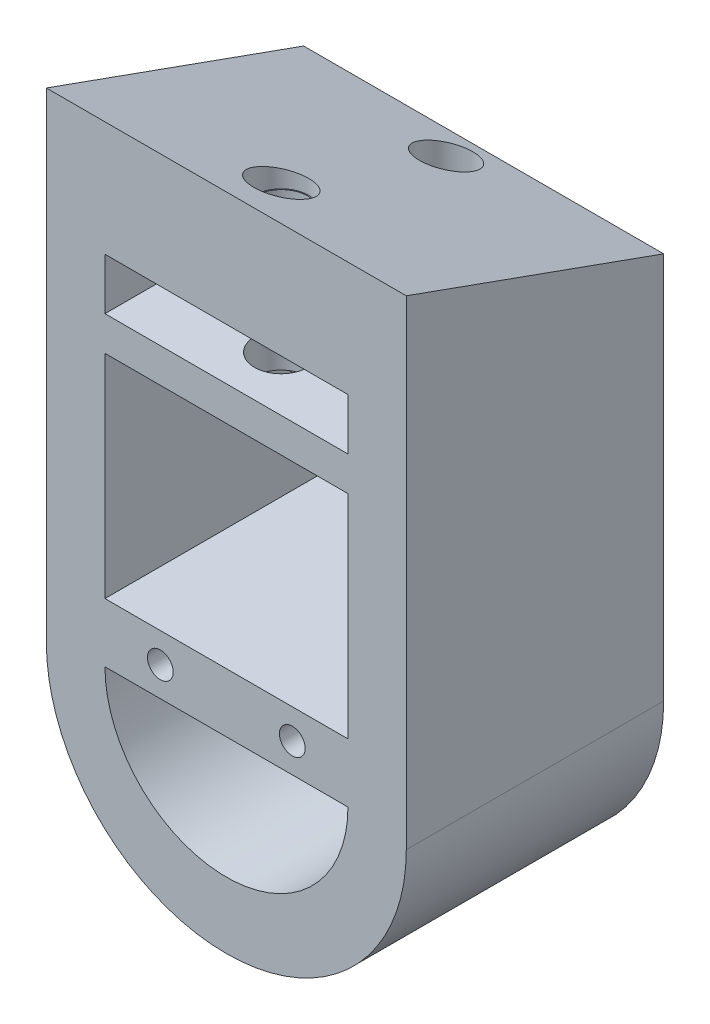
ISO-10303-21;
HEADER;
FILE_DESCRIPTION(('STEP AP214'),'2;1');
FILE_NAME('part.step','',(''),(''),'','','');
FILE_SCHEMA(('AUTOMOTIVE_DESIGN { 1 0 10303 214 1 1 1 1 }'));
ENDSEC;
DATA;
#1=APPLICATION_CONTEXT('core data for automotive mechanical design processes');
#2=APPLICATION_PROTOCOL_DEFINITION('international standard','automotive_design',2000,#1);
#3=PRODUCT_CONTEXT('',#1,'mechanical');
#4=PRODUCT('Part','Part','',(#3));
#5=PRODUCT_RELATED_PRODUCT_CATEGORY('part','',(#4));
#6=PRODUCT_DEFINITION_FORMATION('','',#4);
#7=PRODUCT_DEFINITION_CONTEXT('part definition',#1,'design');
#8=PRODUCT_DEFINITION('design','',#6,#7);
#9=PRODUCT_DEFINITION_SHAPE('','',#8);
#10=(LENGTH_UNIT() NAMED_UNIT(*) SI_UNIT(.MILLI.,.METRE.));
#11=(NAMED_UNIT(*) PLANE_ANGLE_UNIT() SI_UNIT($,.RADIAN.));
#12=(NAMED_UNIT(*) SI_UNIT($,.STERADIAN.) SOLID_ANGLE_UNIT());
#13=UNCERTAINTY_MEASURE_WITH_UNIT(LENGTH_MEASURE(1.E-05),#10,'distance_accuracy_value','');
#14=(GEOMETRIC_REPRESENTATION_CONTEXT(3) GLOBAL_UNCERTAINTY_ASSIGNED_CONTEXT((#13)) GLOBAL_UNIT_ASSIGNED_CONTEXT((#10,
#11,#12)) REPRESENTATION_CONTEXT('',''));
#15=CARTESIAN_POINT('',(0.,0.,0.));
#16=DIRECTION('',(0.,0.,1.));
#17=DIRECTION('',(1.,0.,0.));
#18=AXIS2_PLACEMENT_3D('',#15,#16,#17);
#19=CARTESIAN_POINT('',(-7.0731814338103,0.,20.));
#20=DIRECTION('',(1.,0.,0.));
#21=DIRECTION('',(0.,1.,0.));
#22=AXIS2_PLACEMENT_3D('',#19,#20,#21);
#23=PLANE('',#22);
#24=DIRECTION('',(0.,-1.,0.));
#25=VECTOR('',#24,1.);
#26=CARTESIAN_POINT('',(-7.0731814338103,0.,0.));
#27=LINE('',#26,#25);
#28=CARTESIAN_POINT('',(-7.0731814338103,-4.22839662316623,0.));
#29=VERTEX_POINT('',#28);
#30=CARTESIAN_POINT('',(-7.0731814338103,-11.1068410590705,0.));
#31=VERTEX_POINT('',#30);
#32=EDGE_CURVE('E193',#29,#31,#27,.T.);
#33=ORIENTED_EDGE('',*,*,#32,.F.);
#34=DIRECTION('',(0.,0.,-1.));
#35=VECTOR('',#34,1.);
#36=CARTESIAN_POINT('',(-7.0731814338103,-4.22839662316623,5.));
#37=LINE('',#36,#35);
#38=CARTESIAN_POINT('',(-7.0731814338103,-4.22839662316623,5.));
#39=VERTEX_POINT('',#38);
#40=EDGE_CURVE('E174',#39,#29,#37,.T.);
#41=ORIENTED_EDGE('',*,*,#40,.F.);
#42=DIRECTION('',(0.,-1.,0.));
#43=VECTOR('',#42,1.);
#44=CARTESIAN_POINT('',(-7.0731814338103,-1.72839662316623,5.));
#45=LINE('',#44,#43);
#46=CARTESIAN_POINT('',(-7.0731814338103,-1.72839662316623,5.));
#47=VERTEX_POINT('',#46);
#48=EDGE_CURVE('E179',#47,#39,#45,.T.);
#49=ORIENTED_EDGE('',*,*,#48,.F.);
#50=DIRECTION('',(0.,0.,-1.));
#51=VECTOR('',#50,1.);
#52=CARTESIAN_POINT('',(-7.0731814338103,-1.72839662316623,5.));
#53=LINE('',#52,#51);
#54=CARTESIAN_POINT('',(-7.0731814338103,-1.72839662316623,0.));
#55=VERTEX_POINT('',#54);
#56=EDGE_CURVE('E484',#47,#55,#53,.T.);
#57=ORIENTED_EDGE('',*,*,#56,.T.);
#58=CARTESIAN_POINT('',(-7.0731814338103,1.27160337683377,0.));
#59=VERTEX_POINT('',#58);
#60=EDGE_CURVE('E345',#59,#55,#27,.T.);
#61=ORIENTED_EDGE('',*,*,#60,.F.);
#62=DIRECTION('',(0.,0.,-1.));
#63=VECTOR('',#62,1.);
#64=CARTESIAN_POINT('',(-7.0731814338103,1.27160337683377,15.));
#65=LINE('',#64,#63);
#66=CARTESIAN_POINT('',(-7.0731814338103,1.27160337683377,15.));
#67=VERTEX_POINT('',#66);
#68=EDGE_CURVE('E254',#67,#59,#65,.T.);
#69=ORIENTED_EDGE('',*,*,#68,.F.);
#70=DIRECTION('',(0.,1.,0.));
#71=VECTOR('',#70,1.);
#72=CARTESIAN_POINT('',(-7.0731814338103,0.,15.));
#73=LINE('',#72,#71);
#74=CARTESIAN_POINT('',(-7.0731814338103,-11.1068410590705,15.));
#75=VERTEX_POINT('',#74);
#76=EDGE_CURVE('E325',#75,#67,#73,.T.);
#77=ORIENTED_EDGE('',*,*,#76,.F.);
#78=DIRECTION('',(0.,0.,-1.));
#79=VECTOR('',#78,1.);
#80=CARTESIAN_POINT('',(-7.0731814338103,-11.1068410590705,20.));
#81=LINE('',#80,#79);
#82=EDGE_CURVE('E382',#75,#31,#81,.T.);
#83=ORIENTED_EDGE('',*,*,#82,.T.);
#84=EDGE_LOOP('',(#33,#41,#49,#57,#61,#69,#77,#83));
#85=FACE_BOUND('',#84,.T.);
#86=ADVANCED_FACE('F43',(#85),#23,.T.);
#87=CARTESIAN_POINT('',(7.08895690976563,0.,20.));
#88=DIRECTION('',(1.,0.,0.));
#89=DIRECTION('',(0.,0.,-1.));
#90=AXIS2_PLACEMENT_3D('',#87,#88,#89);
#91=PLANE('',#90);
#92=DIRECTION('',(0.,0.,-1.));
#93=VECTOR('',#92,1.);
#94=CARTESIAN_POINT('',(7.08895690976563,-4.22839662316623,5.));
#95=LINE('',#94,#93);
#96=CARTESIAN_POINT('',(7.08895690976563,-4.22839662316623,5.));
#97=VERTEX_POINT('',#96);
#98=CARTESIAN_POINT('',(7.08895690976563,-4.22839662316623,0.));
#99=VERTEX_POINT('',#98);
#100=EDGE_CURVE('E176',#97,#99,#95,.T.);
#101=ORIENTED_EDGE('',*,*,#100,.T.);
#102=DIRECTION('',(0.,-1.,0.));
#103=VECTOR('',#102,1.);
#104=CARTESIAN_POINT('',(7.08895690976563,0.,0.));
#105=LINE('',#104,#103);
#106=CARTESIAN_POINT('',(7.08895690976563,-11.1068410590705,0.));
#107=VERTEX_POINT('',#106);
#108=EDGE_CURVE('E349',#99,#107,#105,.T.);
#109=ORIENTED_EDGE('',*,*,#108,.T.);
#110=DIRECTION('',(0.,0.,-1.));
#111=VECTOR('',#110,1.);
#112=CARTESIAN_POINT('',(7.08895690976563,-11.1068410590705,20.));
#113=LINE('',#112,#111);
#114=CARTESIAN_POINT('',(7.08895690976563,-11.1068410590705,15.));
#115=VERTEX_POINT('',#114);
#116=EDGE_CURVE('E380',#115,#107,#113,.T.);
#117=ORIENTED_EDGE('',*,*,#116,.F.);
#118=DIRECTION('',(0.,1.,0.));
#119=VECTOR('',#118,1.);
#120=CARTESIAN_POINT('',(7.08895690976563,0.,15.));
#121=LINE('',#120,#119);
#122=CARTESIAN_POINT('',(7.08895690976563,1.27160337683377,15.));
#123=VERTEX_POINT('',#122);
#124=EDGE_CURVE('E318',#115,#123,#121,.T.);
#125=ORIENTED_EDGE('',*,*,#124,.T.);
#126=DIRECTION('',(0.,0.,-1.));
#127=VECTOR('',#126,1.);
#128=CARTESIAN_POINT('',(7.08895690976563,1.27160337683377,15.));
#129=LINE('',#128,#127);
#130=CARTESIAN_POINT('',(7.08895690976563,1.27160337683377,0.));
#131=VERTEX_POINT('',#130);
#132=EDGE_CURVE('E250',#123,#131,#129,.T.);
#133=ORIENTED_EDGE('',*,*,#132,.T.);
#134=CARTESIAN_POINT('',(7.08895690976563,-1.72839662316623,0.));
#135=VERTEX_POINT('',#134);
#136=EDGE_CURVE('E351',#131,#135,#105,.T.);
#137=ORIENTED_EDGE('',*,*,#136,.T.);
#138=DIRECTION('',(0.,0.,-1.));
#139=VECTOR('',#138,1.);
#140=CARTESIAN_POINT('',(7.08895690976563,-1.72839662316623,5.));
#141=LINE('',#140,#139);
#142=CARTESIAN_POINT('',(7.08895690976563,-1.72839662316623,5.));
#143=VERTEX_POINT('',#142);
#144=EDGE_CURVE('E66',#143,#135,#141,.T.);
#145=ORIENTED_EDGE('',*,*,#144,.F.);
#146=DIRECTION('',(0.,1.,0.));
#147=VECTOR('',#146,1.);
#148=CARTESIAN_POINT('',(7.08895690976563,-1.72839662316623,5.));
#149=LINE('',#148,#147);
#150=EDGE_CURVE('E61',#97,#143,#149,.T.);
#151=ORIENTED_EDGE('',*,*,#150,.F.);
#152=EDGE_LOOP('',(#101,#109,#117,#125,#133,#137,#145,#151));
#153=FACE_BOUND('',#152,.T.);
#154=ADVANCED_FACE('F422',(#153),#91,.F.);
#155=CARTESIAN_POINT('',(-10.4889569097656,12.9548768402875,15.));
#156=DIRECTION('',(0.,-0.941259230068552,0.337684855761636));
#157=DIRECTION('',(0.,-0.337684855761637,-0.941259230068552));
#158=AXIS2_PLACEMENT_3D('',#155,#156,#157);
#159=PLANE('',#158);
#160=CARTESIAN_POINT('',(0.,8.3596899757842,2.19142426346608));
#161=DIRECTION('',(0.,-0.941259230068552,0.337684855761636));
#162=DIRECTION('',(0.,-0.337684855761637,-0.941259230068552));
#163=AXIS2_PLACEMENT_3D('',#160,#161,#162);
#164=ELLIPSE('',#163,1.64673019980597,1.55);
#165=CARTESIAN_POINT('',(0.,7.80361412578439,0.641424263466078));
#166=VERTEX_POINT('',#165);
#167=EDGE_CURVE('E480',#166,#166,#164,.F.);
#168=ORIENTED_EDGE('',*,*,#167,.F.);
#169=EDGE_LOOP('',(#168));
#170=FACE_BOUND('',#169,.T.);
#171=DIRECTION('',(0.,-0.337684855761637,-0.941259230068552));
#172=VECTOR('',#171,1.);
#173=CARTESIAN_POINT('',(10.4889569097656,12.9548768402875,15.));
#174=LINE('',#173,#172);
#175=CARTESIAN_POINT('',(10.4889569097656,12.9548768402875,15.));
#176=VERTEX_POINT('',#175);
#177=CARTESIAN_POINT('',(10.4889569097656,7.57349764674091,0.));
#178=VERTEX_POINT('',#177);
#179=EDGE_CURVE('E277',#176,#178,#174,.T.);
#180=ORIENTED_EDGE('',*,*,#179,.T.);
#181=DIRECTION('',(1.,0.,0.));
#182=VECTOR('',#181,1.);
#183=CARTESIAN_POINT('',(-10.4889569097656,7.57349764674091,0.));
#184=LINE('',#183,#182);
#185=CARTESIAN_POINT('',(-10.4889569097656,7.57349764674091,0.));
#186=VERTEX_POINT('',#185);
#187=EDGE_CURVE('E285',#186,#178,#184,.T.);
#188=ORIENTED_EDGE('',*,*,#187,.F.);
#189=DIRECTION('',(0.,-0.337684855761637,-0.941259230068552));
#190=VECTOR('',#189,1.);
#191=CARTESIAN_POINT('',(-10.4889569097656,12.9548768402875,15.));
#192=LINE('',#191,#190);
#193=CARTESIAN_POINT('',(-10.4889569097656,12.9548768402875,15.));
#194=VERTEX_POINT('',#193);
#195=EDGE_CURVE('E281',#194,#186,#192,.T.);
#196=ORIENTED_EDGE('',*,*,#195,.F.);
#197=DIRECTION('',(1.,0.,0.));
#198=VECTOR('',#197,1.);
#199=CARTESIAN_POINT('',(12.,12.9548768402875,15.));
#200=LINE('',#199,#198);
#201=EDGE_CURVE('E300',#194,#176,#200,.T.);
#202=ORIENTED_EDGE('',*,*,#201,.T.);
#203=EDGE_LOOP('',(#180,#188,#196,#202));
#204=FACE_BOUND('',#203,.T.);
#205=CARTESIAN_POINT('',(0.,11.805398583574,11.7959563467709));
#206=DIRECTION('',(0.,-0.941259230068552,0.337684855761636));
#207=DIRECTION('',(0.,-0.337684855761637,-0.941259230068552));
#208=AXIS2_PLACEMENT_3D('',#205,#206,#207);
#209=ELLIPSE('',#208,1.69985052883197,1.6);
#210=CARTESIAN_POINT('',(0.,11.231384802929,10.1959563467709));
#211=VERTEX_POINT('',#210);
#212=EDGE_CURVE('E288',#211,#211,#209,.T.);
#213=ORIENTED_EDGE('',*,*,#212,.T.);
#214=EDGE_LOOP('',(#213));
#215=FACE_BOUND('',#214,.T.);
#216=ADVANCED_FACE('F428',(#170,#204,#215),#159,.F.);
#217=CARTESIAN_POINT('',(-7.07318143381031,3.27160337683377,15.));
#218=VERTEX_POINT('',#217);
#219=CARTESIAN_POINT('',(-7.0731814338103,6.27160337683377,15.));
#220=VERTEX_POINT('',#219);
#221=EDGE_CURVE('E324',#218,#220,#73,.T.);
#222=ORIENTED_EDGE('',*,*,#221,.F.);
#223=DIRECTION('',(0.,0.,-1.));
#224=VECTOR('',#223,1.);
#225=CARTESIAN_POINT('',(-7.0731814338103,3.27160337683377,15.));
#226=LINE('',#225,#224);
#227=CARTESIAN_POINT('',(-7.0731814338103,3.27160337683377,0.));
#228=VERTEX_POINT('',#227);
#229=EDGE_CURVE('E237',#218,#228,#226,.T.);
#230=ORIENTED_EDGE('',*,*,#229,.T.);
#231=CARTESIAN_POINT('',(-7.0731814338103,6.27160337683377,0.));
#232=VERTEX_POINT('',#231);
#233=EDGE_CURVE('E350',#232,#228,#27,.T.);
#234=ORIENTED_EDGE('',*,*,#233,.F.);
#235=DIRECTION('',(0.,0.,-1.));
#236=VECTOR('',#235,1.);
#237=CARTESIAN_POINT('',(-7.0731814338103,6.27160337683377,15.));
#238=LINE('',#237,#236);
#239=EDGE_CURVE('E270',#220,#232,#238,.T.);
#240=ORIENTED_EDGE('',*,*,#239,.F.);
#241=EDGE_LOOP('',(#222,#230,#234,#240));
#242=FACE_BOUND('',#241,.T.);
#243=ADVANCED_FACE('F424',(#242),#23,.T.);
#244=DIRECTION('',(0.,0.,-1.));
#245=VECTOR('',#244,1.);
#246=CARTESIAN_POINT('',(7.08895690976563,3.27160337683377,15.));
#247=LINE('',#246,#245);
#248=CARTESIAN_POINT('',(7.08895690976563,3.27160337683377,15.));
#249=VERTEX_POINT('',#248);
#250=CARTESIAN_POINT('',(7.08895690976563,3.27160337683377,0.));
#251=VERTEX_POINT('',#250);
#252=EDGE_CURVE('E246',#249,#251,#247,.T.);
#253=ORIENTED_EDGE('',*,*,#252,.F.);
#254=DIRECTION('',(0.,1.,0.));
#255=VECTOR('',#254,1.);
#256=CARTESIAN_POINT('',(7.08895690976563,0.,15.));
#257=LINE('',#256,#255);
#258=CARTESIAN_POINT('',(7.08895690976563,6.27160337683377,15.));
#259=VERTEX_POINT('',#258);
#260=EDGE_CURVE('E321',#249,#259,#257,.T.);
#261=ORIENTED_EDGE('',*,*,#260,.T.);
#262=DIRECTION('',(0.,0.,-1.));
#263=VECTOR('',#262,1.);
#264=CARTESIAN_POINT('',(7.08895690976563,6.27160337683377,15.));
#265=LINE('',#264,#263);
#266=CARTESIAN_POINT('',(7.08895690976563,6.27160337683377,0.));
#267=VERTEX_POINT('',#266);
#268=EDGE_CURVE('E263',#259,#267,#265,.T.);
#269=ORIENTED_EDGE('',*,*,#268,.T.);
#270=EDGE_CURVE('E355',#267,#251,#105,.T.);
#271=ORIENTED_EDGE('',*,*,#270,.T.);
#272=EDGE_LOOP('',(#253,#261,#269,#271));
#273=FACE_BOUND('',#272,.T.);
#274=ADVANCED_FACE('F430',(#273),#91,.F.);
#275=CARTESIAN_POINT('',(-10.4889569097656,0.,20.));
#276=DIRECTION('',(1.,0.,0.));
#277=DIRECTION('',(0.,0.,-1.));
#278=AXIS2_PLACEMENT_3D('',#275,#276,#277);
#279=PLANE('',#278);
#280=DIRECTION('',(0.,1.,0.));
#281=VECTOR('',#280,1.);
#282=CARTESIAN_POINT('',(-10.4889569097656,0.,15.));
#283=LINE('',#282,#281);
#284=CARTESIAN_POINT('',(-10.4889569097656,-15.,15.));
#285=VERTEX_POINT('',#284);
#286=EDGE_CURVE('E296',#285,#194,#283,.T.);
#287=ORIENTED_EDGE('',*,*,#286,.T.);
#288=ORIENTED_EDGE('',*,*,#195,.T.);
#289=DIRECTION('',(0.,-1.,0.));
#290=VECTOR('',#289,1.);
#291=CARTESIAN_POINT('',(-10.4889569097656,0.,0.));
#292=LINE('',#291,#290);
#293=CARTESIAN_POINT('',(-10.4889569097656,-15.,0.));
#294=VERTEX_POINT('',#293);
#295=EDGE_CURVE('E359',#186,#294,#292,.T.);
#296=ORIENTED_EDGE('',*,*,#295,.T.);
#297=DIRECTION('',(0.,0.,-1.));
#298=VECTOR('',#297,1.);
#299=CARTESIAN_POINT('',(-10.4889569097656,-15.,20.));
#300=LINE('',#299,#298);
#301=EDGE_CURVE('E11',#285,#294,#300,.T.);
#302=ORIENTED_EDGE('',*,*,#301,.F.);
#303=EDGE_LOOP('',(#287,#288,#296,#302));
#304=FACE_BOUND('',#303,.T.);
#305=ADVANCED_FACE('F438',(#304),#279,.F.);
#306=CARTESIAN_POINT('',(0.,-15.,20.));
#307=DIRECTION('',(0.,0.,-1.));
#308=DIRECTION('',(-1.,0.,0.));
#309=AXIS2_PLACEMENT_3D('',#306,#307,#308);
#310=CYLINDRICAL_SURFACE('',#309,10.4889569097656);
#311=DIRECTION('',(0.,0.,-1.));
#312=VECTOR('',#311,1.);
#313=CARTESIAN_POINT('',(10.4889569097656,-15.,20.));
#314=LINE('',#313,#312);
#315=CARTESIAN_POINT('',(10.4889569097656,-15.,15.));
#316=VERTEX_POINT('',#315);
#317=CARTESIAN_POINT('',(10.4889569097656,-15.,0.));
#318=VERTEX_POINT('',#317);
#319=EDGE_CURVE('E53',#316,#318,#314,.T.);
#320=ORIENTED_EDGE('',*,*,#319,.F.);
#321=CARTESIAN_POINT('',(0.,-15.,15.));
#322=DIRECTION('',(0.,0.,-1.));
#323=DIRECTION('',(-1.,0.,0.));
#324=AXIS2_PLACEMENT_3D('',#321,#322,#323);
#325=CIRCLE('',#324,10.4889569097656);
#326=EDGE_CURVE('E333',#316,#285,#325,.T.);
#327=ORIENTED_EDGE('',*,*,#326,.T.);
#328=ORIENTED_EDGE('',*,*,#301,.T.);
#329=CARTESIAN_POINT('',(0.,-15.,0.));
#330=DIRECTION('',(0.,0.,1.));
#331=DIRECTION('',(1.,0.,0.));
#332=AXIS2_PLACEMENT_3D('',#329,#330,#331);
#333=CIRCLE('',#332,10.4889569097656);
#334=EDGE_CURVE('E362',#294,#318,#333,.T.);
#335=ORIENTED_EDGE('',*,*,#334,.T.);
#336=EDGE_LOOP('',(#320,#327,#328,#335));
#337=FACE_BOUND('',#336,.T.);
#338=ADVANCED_FACE('F748',(#337),#310,.T.);
#339=CARTESIAN_POINT('',(10.4889569097656,0.,20.));
#340=DIRECTION('',(1.,0.,0.));
#341=DIRECTION('',(0.,0.,-1.));
#342=AXIS2_PLACEMENT_3D('',#339,#340,#341);
#343=PLANE('',#342);
#344=ORIENTED_EDGE('',*,*,#179,.F.);
#345=DIRECTION('',(0.,1.,0.));
#346=VECTOR('',#345,1.);
#347=CARTESIAN_POINT('',(10.4889569097656,0.,15.));
#348=LINE('',#347,#346);
#349=EDGE_CURVE('E292',#316,#176,#348,.T.);
#350=ORIENTED_EDGE('',*,*,#349,.F.);
#351=ORIENTED_EDGE('',*,*,#319,.T.);
#352=DIRECTION('',(0.,-1.,0.));
#353=VECTOR('',#352,1.);
#354=CARTESIAN_POINT('',(10.4889569097656,0.,0.));
#355=LINE('',#354,#353);
#356=EDGE_CURVE('E366',#178,#318,#355,.T.);
#357=ORIENTED_EDGE('',*,*,#356,.F.);
#358=EDGE_LOOP('',(#344,#350,#351,#357));
#359=FACE_BOUND('',#358,.T.);
#360=ADVANCED_FACE('F743',(#359),#343,.T.);
#361=CARTESIAN_POINT('',(0.00788773797766491,-14.5468410590705,20.));
#362=DIRECTION('',(0.,0.,-1.));
#363=DIRECTION('',(-1.,0.,0.));
#364=AXIS2_PLACEMENT_3D('',#361,#362,#363);
#365=CYLINDRICAL_SURFACE('',#364,7.08106917178797);
#366=CARTESIAN_POINT('',(0.00788773797766491,-14.5468410590705,15.));
#367=DIRECTION('',(0.,0.,-1.));
#368=DIRECTION('',(-1.,0.,0.));
#369=AXIS2_PLACEMENT_3D('',#366,#367,#368);
#370=CIRCLE('',#369,7.08106917178797);
#371=CARTESIAN_POINT('',(7.08895690976563,-14.5468410590705,15.));
#372=VERTEX_POINT('',#371);
#373=CARTESIAN_POINT('',(-7.0731814338103,-14.5468410590705,15.));
#374=VERTEX_POINT('',#373);
#375=EDGE_CURVE('E311',#372,#374,#370,.T.);
#376=ORIENTED_EDGE('',*,*,#375,.F.);
#377=DIRECTION('',(0.,0.,-1.));
#378=VECTOR('',#377,1.);
#379=CARTESIAN_POINT('',(7.08895690976563,-14.5468410590705,20.));
#380=LINE('',#379,#378);
#381=CARTESIAN_POINT('',(7.08895690976563,-14.5468410590705,0.));
#382=VERTEX_POINT('',#381);
#383=EDGE_CURVE('E377',#372,#382,#380,.T.);
#384=ORIENTED_EDGE('',*,*,#383,.T.);
#385=CARTESIAN_POINT('',(0.00788773797766491,-14.5468410590705,0.));
#386=DIRECTION('',(0.,0.,1.));
#387=DIRECTION('',(1.,0.,0.));
#388=AXIS2_PLACEMENT_3D('',#385,#386,#387);
#389=CIRCLE('',#388,7.08106917178797);
#390=CARTESIAN_POINT('',(-7.0731814338103,-14.5468410590705,0.));
#391=VERTEX_POINT('',#390);
#392=EDGE_CURVE('E337',#391,#382,#389,.T.);
#393=ORIENTED_EDGE('',*,*,#392,.F.);
#394=DIRECTION('',(0.,0.,-1.));
#395=VECTOR('',#394,1.);
#396=CARTESIAN_POINT('',(-7.0731814338103,-14.5468410590705,20.));
#397=LINE('',#396,#395);
#398=EDGE_CURVE('E385',#374,#391,#397,.T.);
#399=ORIENTED_EDGE('',*,*,#398,.F.);
#400=EDGE_LOOP('',(#376,#384,#393,#399));
#401=FACE_BOUND('',#400,.T.);
#402=ADVANCED_FACE('F45',(#401),#365,.F.);
#403=CARTESIAN_POINT('',(3.84525214097818,-12.8374570664521,20.));
#404=DIRECTION('',(0.,0.,-1.));
#405=DIRECTION('',(-1.,0.,0.));
#406=AXIS2_PLACEMENT_3D('',#403,#404,#405);
#407=CYLINDRICAL_SURFACE('',#406,0.75);
#408=CARTESIAN_POINT('',(3.84525214097818,-12.8374570664521,15.));
#409=DIRECTION('',(0.,0.,-1.));
#410=DIRECTION('',(-1.,0.,0.));
#411=AXIS2_PLACEMENT_3D('',#408,#409,#410);
#412=CIRCLE('',#411,0.75);
#413=CARTESIAN_POINT('',(3.09525214097818,-12.8374570664521,15.));
#414=VERTEX_POINT('',#413);
#415=EDGE_CURVE('E329',#414,#414,#412,.F.);
#416=ORIENTED_EDGE('',*,*,#415,.T.);
#417=EDGE_LOOP('',(#416));
#418=FACE_BOUND('',#417,.T.);
#419=CARTESIAN_POINT('',(3.84525214097818,-12.8374570664521,0.));
#420=DIRECTION('',(0.,0.,1.));
#421=DIRECTION('',(1.,0.,0.));
#422=AXIS2_PLACEMENT_3D('',#419,#420,#421);
#423=CIRCLE('',#422,0.75);
#424=CARTESIAN_POINT('',(4.59525214097818,-12.8374570664521,0.));
#425=VERTEX_POINT('',#424);
#426=EDGE_CURVE('E369',#425,#425,#423,.F.);
#427=ORIENTED_EDGE('',*,*,#426,.T.);
#428=EDGE_LOOP('',(#427));
#429=FACE_BOUND('',#428,.T.);
#430=ADVANCED_FACE('F789',(#418,#429),#407,.F.);
#431=CARTESIAN_POINT('',(0.,-11.1068410590705,20.));
#432=DIRECTION('',(0.,1.,0.));
#433=DIRECTION('',(-1.,0.,0.));
#434=AXIS2_PLACEMENT_3D('',#431,#432,#433);
#435=PLANE('',#434);
#436=DIRECTION('',(-1.,0.,0.));
#437=VECTOR('',#436,1.);
#438=CARTESIAN_POINT('',(0.,-11.1068410590705,15.));
#439=LINE('',#438,#437);
#440=EDGE_CURVE('E314',#115,#75,#439,.T.);
#441=ORIENTED_EDGE('',*,*,#440,.F.);
#442=ORIENTED_EDGE('',*,*,#116,.T.);
#443=DIRECTION('',(1.,0.,0.));
#444=VECTOR('',#443,1.);
#445=CARTESIAN_POINT('',(0.,-11.1068410590705,0.));
#446=LINE('',#445,#444);
#447=EDGE_CURVE('E354',#31,#107,#446,.T.);
#448=ORIENTED_EDGE('',*,*,#447,.F.);
#449=ORIENTED_EDGE('',*,*,#82,.F.);
#450=EDGE_LOOP('',(#441,#442,#448,#449));
#451=FACE_BOUND('',#450,.T.);
#452=ADVANCED_FACE('F465',(#451),#435,.T.);
#453=CARTESIAN_POINT('',(0.,-14.5468410590705,20.));
#454=DIRECTION('',(0.,1.,0.));
#455=DIRECTION('',(0.,0.,1.));
#456=AXIS2_PLACEMENT_3D('',#453,#454,#455);
#457=PLANE('',#456);
#458=ORIENTED_EDGE('',*,*,#383,.F.);
#459=DIRECTION('',(-1.,0.,0.));
#460=VECTOR('',#459,1.);
#461=CARTESIAN_POINT('',(0.,-14.5468410590705,15.));
#462=LINE('',#461,#460);
#463=EDGE_CURVE('E307',#372,#374,#462,.T.);
#464=ORIENTED_EDGE('',*,*,#463,.T.);
#465=ORIENTED_EDGE('',*,*,#398,.T.);
#466=DIRECTION('',(1.,0.,0.));
#467=VECTOR('',#466,1.);
#468=CARTESIAN_POINT('',(0.,-14.5468410590705,0.));
#469=LINE('',#468,#467);
#470=EDGE_CURVE('E341',#391,#382,#469,.T.);
#471=ORIENTED_EDGE('',*,*,#470,.T.);
#472=EDGE_LOOP('',(#458,#464,#465,#471));
#473=FACE_BOUND('',#472,.T.);
#474=ADVANCED_FACE('F770',(#473),#457,.F.);
#475=CARTESIAN_POINT('',(-3.84525214097818,-12.8374570664521,20.));
#476=DIRECTION('',(0.,0.,-1.));
#477=DIRECTION('',(-1.,0.,0.));
#478=AXIS2_PLACEMENT_3D('',#475,#476,#477);
#479=CYLINDRICAL_SURFACE('',#478,0.75);
#480=CARTESIAN_POINT('',(-3.84525214097818,-12.8374570664521,15.));
#481=DIRECTION('',(0.,0.,-1.));
#482=DIRECTION('',(-1.,0.,0.));
#483=AXIS2_PLACEMENT_3D('',#480,#481,#482);
#484=CIRCLE('',#483,0.75);
#485=CARTESIAN_POINT('',(-4.59525214097818,-12.8374570664521,15.));
#486=VERTEX_POINT('',#485);
#487=EDGE_CURVE('E303',#486,#486,#484,.T.);
#488=ORIENTED_EDGE('',*,*,#487,.F.);
#489=EDGE_LOOP('',(#488));
#490=FACE_BOUND('',#489,.T.);
#491=CARTESIAN_POINT('',(-3.84525214097818,-12.8374570664521,0.));
#492=DIRECTION('',(0.,0.,1.));
#493=DIRECTION('',(1.,0.,0.));
#494=AXIS2_PLACEMENT_3D('',#491,#492,#493);
#495=CIRCLE('',#494,0.75);
#496=CARTESIAN_POINT('',(-3.09525214097818,-12.8374570664521,0.));
#497=VERTEX_POINT('',#496);
#498=EDGE_CURVE('E373',#497,#497,#495,.T.);
#499=ORIENTED_EDGE('',*,*,#498,.F.);
#500=EDGE_LOOP('',(#499));
#501=FACE_BOUND('',#500,.T.);
#502=ADVANCED_FACE('F413',(#490,#501),#479,.F.);
#503=CARTESIAN_POINT('',(0.,0.,0.));
#504=DIRECTION('',(0.,0.,1.));
#505=DIRECTION('',(1.,0.,0.));
#506=AXIS2_PLACEMENT_3D('',#503,#504,#505);
#507=PLANE('',#506);
#508=DIRECTION('',(1.,0.,0.));
#509=VECTOR('',#508,1.);
#510=CARTESIAN_POINT('',(-7.0731814338103,-4.22839662316623,0.));
#511=LINE('',#510,#509);
#512=EDGE_CURVE('E468',#29,#99,#511,.T.);
#513=ORIENTED_EDGE('',*,*,#512,.F.);
#514=ORIENTED_EDGE('',*,*,#32,.T.);
#515=ORIENTED_EDGE('',*,*,#447,.T.);
#516=ORIENTED_EDGE('',*,*,#108,.F.);
#517=EDGE_LOOP('',(#513,#514,#515,#516));
#518=FACE_BOUND('',#517,.T.);
#519=ORIENTED_EDGE('',*,*,#187,.T.);
#520=ORIENTED_EDGE('',*,*,#356,.T.);
#521=ORIENTED_EDGE('',*,*,#334,.F.);
#522=ORIENTED_EDGE('',*,*,#295,.F.);
#523=EDGE_LOOP('',(#519,#520,#521,#522));
#524=FACE_BOUND('',#523,.T.);
#525=ORIENTED_EDGE('',*,*,#498,.T.);
#526=EDGE_LOOP('',(#525));
#527=FACE_BOUND('',#526,.T.);
#528=ORIENTED_EDGE('',*,*,#426,.F.);
#529=EDGE_LOOP('',(#528));
#530=FACE_BOUND('',#529,.T.);
#531=ORIENTED_EDGE('',*,*,#392,.T.);
#532=ORIENTED_EDGE('',*,*,#470,.F.);
#533=EDGE_LOOP('',(#531,#532));
#534=FACE_BOUND('',#533,.T.);
#535=DIRECTION('',(-1.,0.,0.));
#536=VECTOR('',#535,1.);
#537=CARTESIAN_POINT('',(0.,6.27160337683377,0.));
#538=LINE('',#537,#536);
#539=EDGE_CURVE('E258',#267,#232,#538,.T.);
#540=ORIENTED_EDGE('',*,*,#539,.T.);
#541=ORIENTED_EDGE('',*,*,#233,.T.);
#542=DIRECTION('',(-1.,0.,0.));
#543=VECTOR('',#542,1.);
#544=CARTESIAN_POINT('',(-7.0731814338103,3.27160337683377,0.));
#545=LINE('',#544,#543);
#546=EDGE_CURVE('E233',#251,#228,#545,.T.);
#547=ORIENTED_EDGE('',*,*,#546,.F.);
#548=ORIENTED_EDGE('',*,*,#270,.F.);
#549=EDGE_LOOP('',(#540,#541,#547,#548));
#550=FACE_BOUND('',#549,.T.);
#551=DIRECTION('',(1.,0.,0.));
#552=VECTOR('',#551,1.);
#553=CARTESIAN_POINT('',(-7.0731814338103,1.27160337683377,0.));
#554=LINE('',#553,#552);
#555=EDGE_CURVE('E227',#59,#131,#554,.T.);
#556=ORIENTED_EDGE('',*,*,#555,.F.);
#557=ORIENTED_EDGE('',*,*,#60,.T.);
#558=DIRECTION('',(-1.,0.,0.));
#559=VECTOR('',#558,1.);
#560=CARTESIAN_POINT('',(-7.0731814338103,-1.72839662316623,0.));
#561=LINE('',#560,#559);
#562=EDGE_CURVE('E189',#135,#55,#561,.T.);
#563=ORIENTED_EDGE('',*,*,#562,.F.);
#564=ORIENTED_EDGE('',*,*,#136,.F.);
#565=EDGE_LOOP('',(#556,#557,#563,#564));
#566=FACE_BOUND('',#565,.T.);
#567=ADVANCED_FACE('F402',(#518,#524,#527,#530,#534,#550,#566),#507,.F.);
#568=CARTESIAN_POINT('',(0.,50.,11.7959563467709));
#569=DIRECTION('',(0.,-1.,0.));
#570=DIRECTION('',(0.,0.,-1.));
#571=AXIS2_PLACEMENT_3D('',#568,#569,#570);
#572=CYLINDRICAL_SURFACE('',#571,1.6);
#573=ORIENTED_EDGE('',*,*,#212,.F.);
#574=EDGE_LOOP('',(#573));
#575=FACE_BOUND('',#574,.T.);
#576=CARTESIAN_POINT('',(0.,10.3768501504614,11.7959563467709));
#577=DIRECTION('',(0.,1.,0.));
#578=DIRECTION('',(0.,0.,1.));
#579=AXIS2_PLACEMENT_3D('',#576,#577,#578);
#580=CIRCLE('',#579,1.6);
#581=CARTESIAN_POINT('',(0.,10.3768501504614,13.3959563467709));
#582=VERTEX_POINT('',#581);
#583=EDGE_CURVE('E336',#582,#582,#580,.T.);
#584=ORIENTED_EDGE('',*,*,#583,.F.);
#585=EDGE_LOOP('',(#584));
#586=FACE_BOUND('',#585,.T.);
#587=ADVANCED_FACE('F399',(#575,#586),#572,.F.);
#588=CARTESIAN_POINT('',(-10.4889569097656,0.,15.));
#589=DIRECTION('',(0.,0.,-1.));
#590=DIRECTION('',(-1.,0.,0.));
#591=AXIS2_PLACEMENT_3D('',#588,#589,#590);
#592=PLANE('',#591);
#593=ORIENTED_EDGE('',*,*,#440,.T.);
#594=ORIENTED_EDGE('',*,*,#76,.T.);
#595=DIRECTION('',(1.,0.,0.));
#596=VECTOR('',#595,1.);
#597=CARTESIAN_POINT('',(-7.0731814338103,1.27160337683377,15.));
#598=LINE('',#597,#596);
#599=EDGE_CURVE('E228',#67,#123,#598,.T.);
#600=ORIENTED_EDGE('',*,*,#599,.T.);
#601=ORIENTED_EDGE('',*,*,#124,.F.);
#602=EDGE_LOOP('',(#593,#594,#600,#601));
#603=FACE_BOUND('',#602,.T.);
#604=DIRECTION('',(-1.,0.,0.));
#605=VECTOR('',#604,1.);
#606=CARTESIAN_POINT('',(-7.0731814338103,3.27160337683377,15.));
#607=LINE('',#606,#605);
#608=EDGE_CURVE('E232',#249,#218,#607,.T.);
#609=ORIENTED_EDGE('',*,*,#608,.T.);
#610=ORIENTED_EDGE('',*,*,#221,.T.);
#611=DIRECTION('',(-1.,0.,0.));
#612=VECTOR('',#611,1.);
#613=CARTESIAN_POINT('',(0.,6.27160337683377,15.));
#614=LINE('',#613,#612);
#615=EDGE_CURVE('E259',#259,#220,#614,.T.);
#616=ORIENTED_EDGE('',*,*,#615,.F.);
#617=ORIENTED_EDGE('',*,*,#260,.F.);
#618=EDGE_LOOP('',(#609,#610,#616,#617));
#619=FACE_BOUND('',#618,.T.);
#620=ORIENTED_EDGE('',*,*,#349,.T.);
#621=ORIENTED_EDGE('',*,*,#201,.F.);
#622=ORIENTED_EDGE('',*,*,#286,.F.);
#623=ORIENTED_EDGE('',*,*,#326,.F.);
#624=EDGE_LOOP('',(#620,#621,#622,#623));
#625=FACE_BOUND('',#624,.T.);
#626=ORIENTED_EDGE('',*,*,#415,.F.);
#627=EDGE_LOOP('',(#626));
#628=FACE_BOUND('',#627,.T.);
#629=ORIENTED_EDGE('',*,*,#375,.T.);
#630=ORIENTED_EDGE('',*,*,#463,.F.);
#631=EDGE_LOOP('',(#629,#630));
#632=FACE_BOUND('',#631,.T.);
#633=ORIENTED_EDGE('',*,*,#487,.T.);
#634=EDGE_LOOP('',(#633));
#635=FACE_BOUND('',#634,.T.);
#636=ADVANCED_FACE('F401',(#603,#619,#625,#628,#632,#635),#592,.F.);
#637=CARTESIAN_POINT('',(0.,6.27160337683377,15.));
#638=DIRECTION('',(0.,-1.,0.));
#639=DIRECTION('',(0.,0.,-1.));
#640=AXIS2_PLACEMENT_3D('',#637,#638,#639);
#641=PLANE('',#640);
#642=CARTESIAN_POINT('',(0.,6.27160337683377,2.19142426346608));
#643=DIRECTION('',(0.,-1.,0.));
#644=DIRECTION('',(0.,0.,-1.));
#645=AXIS2_PLACEMENT_3D('',#642,#643,#644);
#646=CIRCLE('',#645,1.55);
#647=CARTESIAN_POINT('',(0.,6.27160337683377,0.641424263466078));
#648=VERTEX_POINT('',#647);
#649=EDGE_CURVE('E495',#648,#648,#646,.F.);
#650=ORIENTED_EDGE('',*,*,#649,.T.);
#651=EDGE_LOOP('',(#650));
#652=FACE_BOUND('',#651,.T.);
#653=CARTESIAN_POINT('',(0.,6.27160337683377,11.8056508327026));
#654=DIRECTION('',(0.,-1.,0.));
#655=DIRECTION('',(0.,0.,-1.));
#656=AXIS2_PLACEMENT_3D('',#653,#654,#655);
#657=CIRCLE('',#656,1.55);
#658=CARTESIAN_POINT('',(0.,6.27160337683377,10.2556508327026));
#659=VERTEX_POINT('',#658);
#660=EDGE_CURVE('E219',#659,#659,#657,.F.);
#661=ORIENTED_EDGE('',*,*,#660,.T.);
#662=EDGE_LOOP('',(#661));
#663=FACE_BOUND('',#662,.T.);
#664=ORIENTED_EDGE('',*,*,#539,.F.);
#665=ORIENTED_EDGE('',*,*,#268,.F.);
#666=ORIENTED_EDGE('',*,*,#615,.T.);
#667=ORIENTED_EDGE('',*,*,#239,.T.);
#668=EDGE_LOOP('',(#664,#665,#666,#667));
#669=FACE_BOUND('',#668,.T.);
#670=ADVANCED_FACE('F410',(#652,#663,#669),#641,.T.);
#671=CARTESIAN_POINT('',(-7.0731814338103,1.27160337683377,15.));
#672=DIRECTION('',(0.,1.,0.));
#673=DIRECTION('',(0.,0.,1.));
#674=AXIS2_PLACEMENT_3D('',#671,#672,#673);
#675=PLANE('',#674);
#676=CARTESIAN_POINT('',(0.,1.27160337683377,2.19142426346608));
#677=DIRECTION('',(0.,1.,0.));
#678=DIRECTION('',(0.,0.,1.));
#679=AXIS2_PLACEMENT_3D('',#676,#677,#678);
#680=CIRCLE('',#679,1.55);
#681=CARTESIAN_POINT('',(0.,1.27160337683377,3.74142426346608));
#682=VERTEX_POINT('',#681);
#683=EDGE_CURVE('E499',#682,#682,#680,.F.);
#684=ORIENTED_EDGE('',*,*,#683,.F.);
#685=EDGE_LOOP('',(#684));
#686=FACE_BOUND('',#685,.T.);
#687=CARTESIAN_POINT('',(0.,1.27160337683377,11.8056508327026));
#688=DIRECTION('',(0.,1.,0.));
#689=DIRECTION('',(0.,0.,1.));
#690=AXIS2_PLACEMENT_3D('',#687,#688,#689);
#691=CIRCLE('',#690,1.55);
#692=CARTESIAN_POINT('',(0.,1.27160337683377,13.3556508327026));
#693=VERTEX_POINT('',#692);
#694=EDGE_CURVE('E215',#693,#693,#691,.F.);
#695=ORIENTED_EDGE('',*,*,#694,.F.);
#696=EDGE_LOOP('',(#695));
#697=FACE_BOUND('',#696,.T.);
#698=ORIENTED_EDGE('',*,*,#555,.T.);
#699=ORIENTED_EDGE('',*,*,#132,.F.);
#700=ORIENTED_EDGE('',*,*,#599,.F.);
#701=ORIENTED_EDGE('',*,*,#68,.T.);
#702=EDGE_LOOP('',(#698,#699,#700,#701));
#703=FACE_BOUND('',#702,.T.);
#704=ADVANCED_FACE('F474',(#686,#697,#703),#675,.F.);
#705=CARTESIAN_POINT('',(-7.0731814338103,3.27160337683377,15.));
#706=DIRECTION('',(0.,-1.,0.));
#707=DIRECTION('',(0.,0.,-1.));
#708=AXIS2_PLACEMENT_3D('',#705,#706,#707);
#709=PLANE('',#708);
#710=CARTESIAN_POINT('',(0.,3.27160337683377,2.19142426346608));
#711=DIRECTION('',(0.,-1.,0.));
#712=DIRECTION('',(0.,0.,-1.));
#713=AXIS2_PLACEMENT_3D('',#710,#711,#712);
#714=CIRCLE('',#713,1.55);
#715=CARTESIAN_POINT('',(0.,3.27160337683377,0.641424263466078));
#716=VERTEX_POINT('',#715);
#717=EDGE_CURVE('E503',#716,#716,#714,.F.);
#718=ORIENTED_EDGE('',*,*,#717,.F.);
#719=EDGE_LOOP('',(#718));
#720=FACE_BOUND('',#719,.T.);
#721=CARTESIAN_POINT('',(0.,3.27160337683377,11.8056508327026));
#722=DIRECTION('',(0.,-1.,0.));
#723=DIRECTION('',(0.,0.,-1.));
#724=AXIS2_PLACEMENT_3D('',#721,#722,#723);
#725=CIRCLE('',#724,1.55);
#726=CARTESIAN_POINT('',(0.,3.27160337683377,10.2556508327026));
#727=VERTEX_POINT('',#726);
#728=EDGE_CURVE('E211',#727,#727,#725,.F.);
#729=ORIENTED_EDGE('',*,*,#728,.F.);
#730=EDGE_LOOP('',(#729));
#731=FACE_BOUND('',#730,.T.);
#732=ORIENTED_EDGE('',*,*,#546,.T.);
#733=ORIENTED_EDGE('',*,*,#229,.F.);
#734=ORIENTED_EDGE('',*,*,#608,.F.);
#735=ORIENTED_EDGE('',*,*,#252,.T.);
#736=EDGE_LOOP('',(#732,#733,#734,#735));
#737=FACE_BOUND('',#736,.T.);
#738=ADVANCED_FACE('F537',(#720,#731,#737),#709,.F.);
#739=CARTESIAN_POINT('',(-7.50000000000001,10.3768501504614,15.));
#740=DIRECTION('',(0.,-1.,0.));
#741=DIRECTION('',(0.,0.,-1.));
#742=AXIS2_PLACEMENT_3D('',#739,#740,#741);
#743=PLANE('',#742);
#744=CARTESIAN_POINT('',(0.,10.3768501504614,11.8056508327026));
#745=DIRECTION('',(0.,-1.,0.));
#746=DIRECTION('',(0.,0.,-1.));
#747=AXIS2_PLACEMENT_3D('',#744,#745,#746);
#748=CIRCLE('',#747,1.55);
#749=CARTESIAN_POINT('',(0.,10.3768501504614,10.2556508327026));
#750=VERTEX_POINT('',#749);
#751=EDGE_CURVE('E207',#750,#750,#748,.F.);
#752=ORIENTED_EDGE('',*,*,#751,.F.);
#753=EDGE_LOOP('',(#752));
#754=FACE_BOUND('',#753,.T.);
#755=ORIENTED_EDGE('',*,*,#583,.T.);
#756=EDGE_LOOP('',(#755));
#757=FACE_BOUND('',#756,.T.);
#758=ADVANCED_FACE('F397',(#754,#757),#743,.F.);
#759=CARTESIAN_POINT('',(0.,20.,11.8056508327026));
#760=DIRECTION('',(0.,-1.,0.));
#761=DIRECTION('',(0.,0.,-1.));
#762=AXIS2_PLACEMENT_3D('',#759,#760,#761);
#763=CYLINDRICAL_SURFACE('',#762,1.55);
#764=CARTESIAN_POINT('',(0.,7.3768501504614,11.8056508327026));
#765=DIRECTION('',(0.,1.,0.));
#766=DIRECTION('',(0.,0.,1.));
#767=AXIS2_PLACEMENT_3D('',#764,#765,#766);
#768=CIRCLE('',#767,1.55);
#769=CARTESIAN_POINT('',(0.,7.3768501504614,13.3556508327026));
#770=VERTEX_POINT('',#769);
#771=EDGE_CURVE('E195',#770,#770,#768,.F.);
#772=ORIENTED_EDGE('',*,*,#771,.T.);
#773=EDGE_LOOP('',(#772));
#774=FACE_BOUND('',#773,.T.);
#775=ORIENTED_EDGE('',*,*,#751,.T.);
#776=EDGE_LOOP('',(#775));
#777=FACE_BOUND('',#776,.T.);
#778=ADVANCED_FACE('F534',(#774,#777),#763,.F.);
#779=ORIENTED_EDGE('',*,*,#660,.F.);
#780=EDGE_LOOP('',(#779));
#781=FACE_BOUND('',#780,.T.);
#782=CARTESIAN_POINT('',(0.,6.93481610718009,11.8056508327026));
#783=DIRECTION('',(0.,-1.,0.));
#784=DIRECTION('',(0.,0.,-1.));
#785=AXIS2_PLACEMENT_3D('',#782,#783,#784);
#786=CIRCLE('',#785,1.55);
#787=CARTESIAN_POINT('',(0.,6.93481610718009,10.2556508327026));
#788=VERTEX_POINT('',#787);
#789=EDGE_CURVE('E200',#788,#788,#786,.F.);
#790=ORIENTED_EDGE('',*,*,#789,.T.);
#791=EDGE_LOOP('',(#790));
#792=FACE_BOUND('',#791,.T.);
#793=ADVANCED_FACE('F532',(#781,#792),#763,.F.);
#794=ORIENTED_EDGE('',*,*,#728,.T.);
#795=EDGE_LOOP('',(#794));
#796=FACE_BOUND('',#795,.T.);
#797=ORIENTED_EDGE('',*,*,#694,.T.);
#798=EDGE_LOOP('',(#797));
#799=FACE_BOUND('',#798,.T.);
#800=ADVANCED_FACE('F529',(#796,#799),#763,.F.);
#801=CARTESIAN_POINT('',(0.,6.9348161071801,15.));
#802=DIRECTION('',(0.,-1.,0.));
#803=DIRECTION('',(0.,0.,-1.));
#804=AXIS2_PLACEMENT_3D('',#801,#802,#803);
#805=PLANE('',#804);
#806=ORIENTED_EDGE('',*,*,#789,.F.);
#807=EDGE_LOOP('',(#806));
#808=FACE_BOUND('',#807,.T.);
#809=CARTESIAN_POINT('',(0.,6.93481610718009,11.7959563467709));
#810=DIRECTION('',(0.,-1.,0.));
#811=DIRECTION('',(0.,0.,-1.));
#812=AXIS2_PLACEMENT_3D('',#809,#810,#811);
#813=CIRCLE('',#812,1.6);
#814=CARTESIAN_POINT('',(0.,6.93481610718009,10.1959563467709));
#815=VERTEX_POINT('',#814);
#816=EDGE_CURVE('E273',#815,#815,#813,.T.);
#817=ORIENTED_EDGE('',*,*,#816,.F.);
#818=EDGE_LOOP('',(#817));
#819=FACE_BOUND('',#818,.T.);
#820=ADVANCED_FACE('F419',(#808,#819),#805,.F.);
#821=CARTESIAN_POINT('',(0.,7.3768501504614,11.7959563467709));
#822=DIRECTION('',(0.,1.,0.));
#823=DIRECTION('',(0.,0.,1.));
#824=AXIS2_PLACEMENT_3D('',#821,#822,#823);
#825=CIRCLE('',#824,1.6);
#826=CARTESIAN_POINT('',(0.,7.3768501504614,13.3959563467709));
#827=VERTEX_POINT('',#826);
#828=EDGE_CURVE('E223',#827,#827,#825,.T.);
#829=ORIENTED_EDGE('',*,*,#828,.T.);
#830=EDGE_LOOP('',(#829));
#831=FACE_BOUND('',#830,.T.);
#832=ORIENTED_EDGE('',*,*,#816,.T.);
#833=EDGE_LOOP('',(#832));
#834=FACE_BOUND('',#833,.T.);
#835=ADVANCED_FACE('F405',(#831,#834),#572,.F.);
#836=CARTESIAN_POINT('',(-7.50000000000001,7.3768501504614,15.));
#837=DIRECTION('',(0.,1.,0.));
#838=DIRECTION('',(0.,0.,1.));
#839=AXIS2_PLACEMENT_3D('',#836,#837,#838);
#840=PLANE('',#839);
#841=ORIENTED_EDGE('',*,*,#771,.F.);
#842=EDGE_LOOP('',(#841));
#843=FACE_BOUND('',#842,.T.);
#844=ORIENTED_EDGE('',*,*,#828,.F.);
#845=EDGE_LOOP('',(#844));
#846=FACE_BOUND('',#845,.T.);
#847=ADVANCED_FACE('F418',(#843,#846),#840,.F.);
#848=CARTESIAN_POINT('',(-7.0731814338103,-4.22839662316623,5.));
#849=DIRECTION('',(0.,1.,0.));
#850=DIRECTION('',(0.,0.,1.));
#851=AXIS2_PLACEMENT_3D('',#848,#849,#850);
#852=PLANE('',#851);
#853=CARTESIAN_POINT('',(0.,-4.22839662316623,2.19142426346608));
#854=DIRECTION('',(0.,1.,0.));
#855=DIRECTION('',(0.,0.,1.));
#856=AXIS2_PLACEMENT_3D('',#853,#854,#855);
#857=CIRCLE('',#856,1.55);
#858=CARTESIAN_POINT('',(0.,-4.22839662316623,3.74142426346608));
#859=VERTEX_POINT('',#858);
#860=EDGE_CURVE('E507',#859,#859,#857,.F.);
#861=ORIENTED_EDGE('',*,*,#860,.F.);
#862=EDGE_LOOP('',(#861));
#863=FACE_BOUND('',#862,.T.);
#864=ORIENTED_EDGE('',*,*,#512,.T.);
#865=ORIENTED_EDGE('',*,*,#100,.F.);
#866=DIRECTION('',(1.,0.,0.));
#867=VECTOR('',#866,1.);
#868=CARTESIAN_POINT('',(-7.0731814338103,-4.22839662316623,5.));
#869=LINE('',#868,#867);
#870=EDGE_CURVE('E169',#39,#97,#869,.T.);
#871=ORIENTED_EDGE('',*,*,#870,.F.);
#872=ORIENTED_EDGE('',*,*,#40,.T.);
#873=EDGE_LOOP('',(#864,#865,#871,#872));
#874=FACE_BOUND('',#873,.T.);
#875=ADVANCED_FACE('F172',(#863,#874),#852,.F.);
#876=CARTESIAN_POINT('',(-7.0731814338103,-1.72839662316623,5.));
#877=DIRECTION('',(0.,-1.,0.));
#878=DIRECTION('',(0.,0.,-1.));
#879=AXIS2_PLACEMENT_3D('',#876,#877,#878);
#880=PLANE('',#879);
#881=CARTESIAN_POINT('',(0.,-1.72839662316623,2.19142426346608));
#882=DIRECTION('',(0.,-1.,0.));
#883=DIRECTION('',(0.,0.,-1.));
#884=AXIS2_PLACEMENT_3D('',#881,#882,#883);
#885=CIRCLE('',#884,1.55);
#886=CARTESIAN_POINT('',(0.,-1.72839662316623,0.641424263466078));
#887=VERTEX_POINT('',#886);
#888=EDGE_CURVE('E47',#887,#887,#885,.F.);
#889=ORIENTED_EDGE('',*,*,#888,.F.);
#890=EDGE_LOOP('',(#889));
#891=FACE_BOUND('',#890,.T.);
#892=ORIENTED_EDGE('',*,*,#562,.T.);
#893=ORIENTED_EDGE('',*,*,#56,.F.);
#894=DIRECTION('',(-1.,0.,0.));
#895=VECTOR('',#894,1.);
#896=CARTESIAN_POINT('',(-7.0731814338103,-1.72839662316623,5.));
#897=LINE('',#896,#895);
#898=EDGE_CURVE('E184',#143,#47,#897,.T.);
#899=ORIENTED_EDGE('',*,*,#898,.F.);
#900=ORIENTED_EDGE('',*,*,#144,.T.);
#901=EDGE_LOOP('',(#892,#893,#899,#900));
#902=FACE_BOUND('',#901,.T.);
#903=ADVANCED_FACE('F487',(#891,#902),#880,.F.);
#904=CARTESIAN_POINT('',(0.,0.,5.));
#905=DIRECTION('',(0.,0.,1.));
#906=DIRECTION('',(1.,0.,0.));
#907=AXIS2_PLACEMENT_3D('',#904,#905,#906);
#908=PLANE('',#907);
#909=ORIENTED_EDGE('',*,*,#48,.T.);
#910=ORIENTED_EDGE('',*,*,#870,.T.);
#911=ORIENTED_EDGE('',*,*,#150,.T.);
#912=ORIENTED_EDGE('',*,*,#898,.T.);
#913=EDGE_LOOP('',(#909,#910,#911,#912));
#914=FACE_BOUND('',#913,.T.);
#915=ADVANCED_FACE('F182',(#914),#908,.T.);
#916=CARTESIAN_POINT('',(0.,10.,2.19142426346608));
#917=DIRECTION('',(0.,-1.,0.));
#918=DIRECTION('',(0.,0.,-1.));
#919=AXIS2_PLACEMENT_3D('',#916,#917,#918);
#920=CYLINDRICAL_SURFACE('',#919,1.55);
#921=ORIENTED_EDGE('',*,*,#888,.T.);
#922=EDGE_LOOP('',(#921));
#923=FACE_BOUND('',#922,.T.);
#924=ORIENTED_EDGE('',*,*,#860,.T.);
#925=EDGE_LOOP('',(#924));
#926=FACE_BOUND('',#925,.T.);
#927=ADVANCED_FACE('F516',(#923,#926),#920,.F.);
#928=ORIENTED_EDGE('',*,*,#717,.T.);
#929=EDGE_LOOP('',(#928));
#930=FACE_BOUND('',#929,.T.);
#931=ORIENTED_EDGE('',*,*,#683,.T.);
#932=EDGE_LOOP('',(#931));
#933=FACE_BOUND('',#932,.T.);
#934=ADVANCED_FACE('F879',(#930,#933),#920,.F.);
#935=ORIENTED_EDGE('',*,*,#649,.F.);
#936=EDGE_LOOP('',(#935));
#937=FACE_BOUND('',#936,.T.);
#938=ORIENTED_EDGE('',*,*,#167,.T.);
#939=EDGE_LOOP('',(#938));
#940=FACE_BOUND('',#939,.T.);
#941=ADVANCED_FACE('F880',(#937,#940),#920,.F.);
#942=CLOSED_SHELL('',(#86,#154,#216,#243,#274,#305,#338,#360,#402,#430,#452,#474,#502,#567,#587,
#636,#670,#704,#738,#758,#778,#793,#800,#820,#835,#847,#875,#903,#915,#927,#934,#941));
#943=MANIFOLD_SOLID_BREP('B2',#942);
#944=ADVANCED_BREP_SHAPE_REPRESENTATION('',(#18,#943),#14);
#945=SHAPE_DEFINITION_REPRESENTATION(#9,#944);
ENDSEC;
END-ISO-10303-21;
